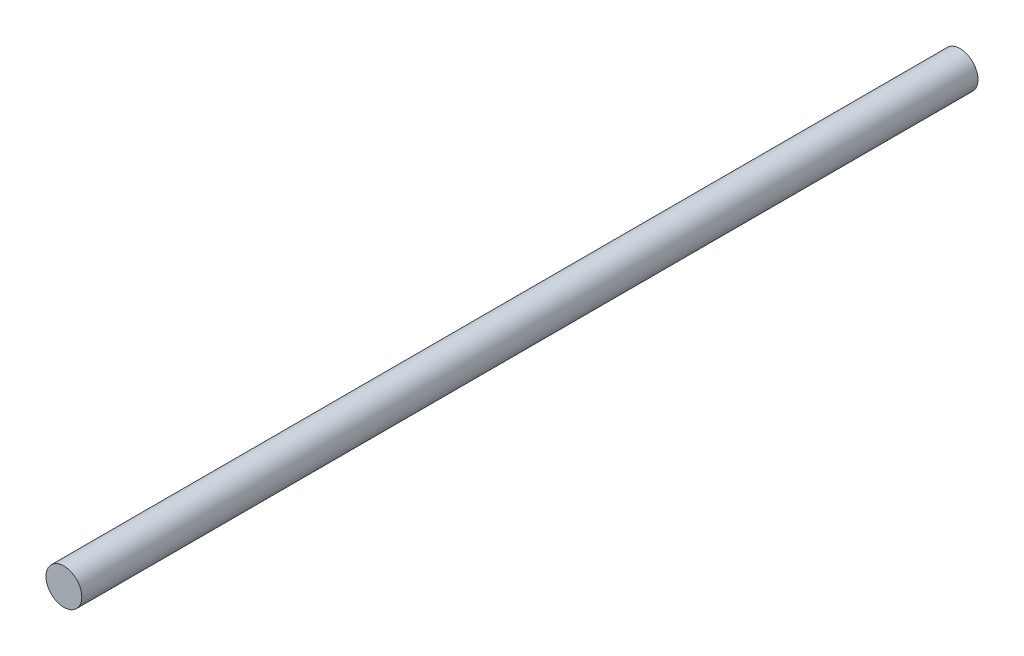
ISO-10303-21;
HEADER;
FILE_DESCRIPTION(('STEP AP214'),'2;1');
FILE_NAME('part.step','',(''),(''),'','','');
FILE_SCHEMA(('AUTOMOTIVE_DESIGN { 1 0 10303 214 1 1 1 1 }'));
ENDSEC;
DATA;
#1=APPLICATION_CONTEXT('core data for automotive mechanical design processes');
#2=APPLICATION_PROTOCOL_DEFINITION('international standard','automotive_design',2000,#1);
#3=PRODUCT_CONTEXT('',#1,'mechanical');
#4=PRODUCT('Part','Part','',(#3));
#5=PRODUCT_RELATED_PRODUCT_CATEGORY('part','',(#4));
#6=PRODUCT_DEFINITION_FORMATION('','',#4);
#7=PRODUCT_DEFINITION_CONTEXT('part definition',#1,'design');
#8=PRODUCT_DEFINITION('design','',#6,#7);
#9=PRODUCT_DEFINITION_SHAPE('','',#8);
#10=(LENGTH_UNIT() NAMED_UNIT(*) SI_UNIT(.MILLI.,.METRE.));
#11=(NAMED_UNIT(*) PLANE_ANGLE_UNIT() SI_UNIT($,.RADIAN.));
#12=(NAMED_UNIT(*) SI_UNIT($,.STERADIAN.) SOLID_ANGLE_UNIT());
#13=UNCERTAINTY_MEASURE_WITH_UNIT(LENGTH_MEASURE(1.E-05),#10,'distance_accuracy_value','');
#14=(GEOMETRIC_REPRESENTATION_CONTEXT(3) GLOBAL_UNCERTAINTY_ASSIGNED_CONTEXT((#13)) GLOBAL_UNIT_ASSIGNED_CONTEXT((#10,
#11,#12)) REPRESENTATION_CONTEXT('',''));
#15=CARTESIAN_POINT('',(0.,0.,0.));
#16=DIRECTION('',(0.,0.,1.));
#17=DIRECTION('',(1.,0.,0.));
#18=AXIS2_PLACEMENT_3D('',#15,#16,#17);
#19=CARTESIAN_POINT('',(-1.3,7.00000000000402,-16.2));
#20=DIRECTION('',(0.,0.,1.));
#21=DIRECTION('',(1.,0.,0.));
#22=AXIS2_PLACEMENT_3D('',#19,#20,#21);
#23=PLANE('',#22);
#24=CARTESIAN_POINT('',(-1.3,7.00000000000402,-16.2));
#25=DIRECTION('',(0.,0.,1.));
#26=DIRECTION('',(-1.,0.,0.));
#27=AXIS2_PLACEMENT_3D('',#24,#25,#26);
#28=CIRCLE('',#27,0.6);
#29=CARTESIAN_POINT('',(-0.7,7.00000000000402,-16.2));
#30=VERTEX_POINT('',#29);
#31=EDGE_CURVE('E11',#30,#30,#28,.T.);
#32=ORIENTED_EDGE('',*,*,#31,.F.);
#33=EDGE_LOOP('',(#32));
#34=FACE_BOUND('',#33,.T.);
#35=ADVANCED_FACE('F17',(#34),#23,.F.);
#36=CARTESIAN_POINT('',(-1.3,7.00000000000402,13.8));
#37=DIRECTION('',(0.,0.,1.));
#38=DIRECTION('',(1.,0.,0.));
#39=AXIS2_PLACEMENT_3D('',#36,#37,#38);
#40=PLANE('',#39);
#41=CARTESIAN_POINT('',(-1.3,7.00000000000402,13.8));
#42=DIRECTION('',(0.,0.,1.));
#43=DIRECTION('',(-1.,0.,0.));
#44=AXIS2_PLACEMENT_3D('',#41,#42,#43);
#45=CIRCLE('',#44,0.6);
#46=CARTESIAN_POINT('',(-0.7,7.00000000000402,13.8));
#47=VERTEX_POINT('',#46);
#48=EDGE_CURVE('E21',#47,#47,#45,.T.);
#49=ORIENTED_EDGE('',*,*,#48,.T.);
#50=EDGE_LOOP('',(#49));
#51=FACE_BOUND('',#50,.T.);
#52=ADVANCED_FACE('F43',(#51),#40,.T.);
#53=CARTESIAN_POINT('',(-1.3,7.00000000000402,-16.2));
#54=DIRECTION('',(0.,0.,1.));
#55=DIRECTION('',(-1.,0.,0.));
#56=AXIS2_PLACEMENT_3D('',#53,#54,#55);
#57=CYLINDRICAL_SURFACE('',#56,0.6);
#58=ORIENTED_EDGE('',*,*,#48,.F.);
#59=DIRECTION('',(0.,0.,-1.));
#60=VECTOR('',#59,1.);
#61=CARTESIAN_POINT('',(-0.7,7.00000000000402,-16.2));
#62=LINE('',#61,#60);
#63=EDGE_CURVE('E28',#47,#30,#62,.T.);
#64=ORIENTED_EDGE('',*,*,#63,.T.);
#65=ORIENTED_EDGE('',*,*,#31,.T.);
#66=ORIENTED_EDGE('',*,*,#63,.F.);
#67=EDGE_LOOP('',(#58,#64,#65,#66));
#68=FACE_BOUND('',#67,.T.);
#69=ADVANCED_FACE('F19',(#68),#57,.T.);
#70=CLOSED_SHELL('',(#35,#52,#69));
#71=MANIFOLD_SOLID_BREP('B1',#70);
#72=ADVANCED_BREP_SHAPE_REPRESENTATION('',(#18,#71),#14);
#73=SHAPE_DEFINITION_REPRESENTATION(#9,#72);
ENDSEC;
END-ISO-10303-21;
